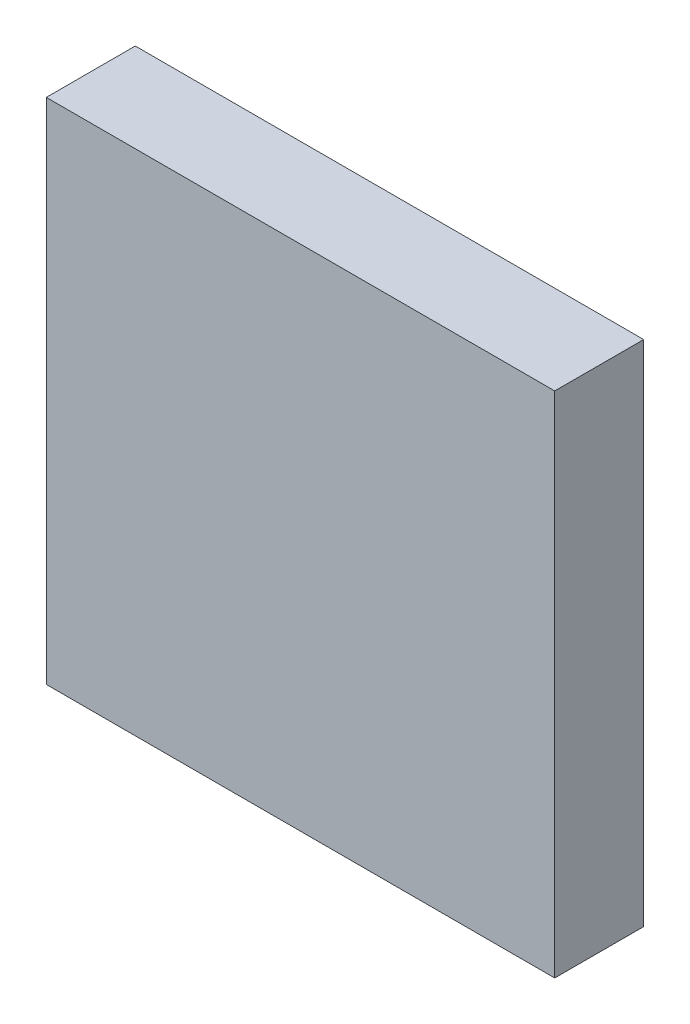
ISO-10303-21;
HEADER;
FILE_DESCRIPTION(('STEP AP214'),'2;1');
FILE_NAME('part.step','',(''),(''),'','','');
FILE_SCHEMA(('AUTOMOTIVE_DESIGN { 1 0 10303 214 1 1 1 1 }'));
ENDSEC;
DATA;
#1=APPLICATION_CONTEXT('core data for automotive mechanical design processes');
#2=APPLICATION_PROTOCOL_DEFINITION('international standard','automotive_design',2000,#1);
#3=PRODUCT_CONTEXT('',#1,'mechanical');
#4=PRODUCT('Part','Part','',(#3));
#5=PRODUCT_RELATED_PRODUCT_CATEGORY('part','',(#4));
#6=PRODUCT_DEFINITION_FORMATION('','',#4);
#7=PRODUCT_DEFINITION_CONTEXT('part definition',#1,'design');
#8=PRODUCT_DEFINITION('design','',#6,#7);
#9=PRODUCT_DEFINITION_SHAPE('','',#8);
#10=(LENGTH_UNIT() NAMED_UNIT(*) SI_UNIT(.MILLI.,.METRE.));
#11=(NAMED_UNIT(*) PLANE_ANGLE_UNIT() SI_UNIT($,.RADIAN.));
#12=(NAMED_UNIT(*) SI_UNIT($,.STERADIAN.) SOLID_ANGLE_UNIT());
#13=UNCERTAINTY_MEASURE_WITH_UNIT(LENGTH_MEASURE(1.E-05),#10,'distance_accuracy_value','');
#14=(GEOMETRIC_REPRESENTATION_CONTEXT(3) GLOBAL_UNCERTAINTY_ASSIGNED_CONTEXT((#13)) GLOBAL_UNIT_ASSIGNED_CONTEXT((#10,
#11,#12)) REPRESENTATION_CONTEXT('',''));
#15=CARTESIAN_POINT('',(0.,0.,0.));
#16=DIRECTION('',(0.,0.,1.));
#17=DIRECTION('',(1.,0.,0.));
#18=AXIS2_PLACEMENT_3D('',#15,#16,#17);
#19=CARTESIAN_POINT('',(-1000.,-1.11022302462516E-13,300.));
#20=DIRECTION('',(1.,0.,0.));
#21=DIRECTION('',(0.,1.,0.));
#22=AXIS2_PLACEMENT_3D('',#19,#20,#21);
#23=PLANE('',#22);
#24=DIRECTION('',(0.,-1.,0.));
#25=VECTOR('',#24,1.);
#26=CARTESIAN_POINT('',(-1000.,-1.11022302462516E-13,0.));
#27=LINE('',#26,#25);
#28=CARTESIAN_POINT('',(-1000.,1000.,0.));
#29=VERTEX_POINT('',#28);
#30=CARTESIAN_POINT('',(-999.999999999999,-1000.,0.));
#31=VERTEX_POINT('',#30);
#32=EDGE_CURVE('E408',#29,#31,#27,.T.);
#33=ORIENTED_EDGE('',*,*,#32,.T.);
#34=DIRECTION('',(0.,0.,-1.));
#35=VECTOR('',#34,1.);
#36=CARTESIAN_POINT('',(-999.999999999999,-1000.,300.));
#37=LINE('',#36,#35);
#38=CARTESIAN_POINT('',(-999.999999999999,-1000.,350.));
#39=VERTEX_POINT('',#38);
#40=EDGE_CURVE('E420',#39,#31,#37,.T.);
#41=ORIENTED_EDGE('',*,*,#40,.F.);
#42=DIRECTION('',(0.,-1.,0.));
#43=VECTOR('',#42,1.);
#44=CARTESIAN_POINT('',(-1000.,1000.,350.));
#45=LINE('',#44,#43);
#46=CARTESIAN_POINT('',(-1000.,1000.,350.));
#47=VERTEX_POINT('',#46);
#48=EDGE_CURVE('E300',#47,#39,#45,.T.);
#49=ORIENTED_EDGE('',*,*,#48,.F.);
#50=DIRECTION('',(0.,0.,-1.));
#51=VECTOR('',#50,1.);
#52=CARTESIAN_POINT('',(-1000.,1000.,300.));
#53=LINE('',#52,#51);
#54=EDGE_CURVE('E295',#47,#29,#53,.T.);
#55=ORIENTED_EDGE('',*,*,#54,.T.);
#56=EDGE_LOOP('',(#33,#41,#49,#55));
#57=FACE_BOUND('',#56,.T.);
#58=ADVANCED_FACE('F91',(#57),#23,.F.);
#59=CARTESIAN_POINT('',(0.,-1000.,300.));
#60=DIRECTION('',(0.,1.,0.));
#61=DIRECTION('',(0.,0.,1.));
#62=AXIS2_PLACEMENT_3D('',#59,#60,#61);
#63=PLANE('',#62);
#64=DIRECTION('',(1.,0.,0.));
#65=VECTOR('',#64,1.);
#66=CARTESIAN_POINT('',(0.,-1000.,0.));
#67=LINE('',#66,#65);
#68=CARTESIAN_POINT('',(1000.,-1000.,0.));
#69=VERTEX_POINT('',#68);
#70=EDGE_CURVE('E412',#31,#69,#67,.T.);
#71=ORIENTED_EDGE('',*,*,#70,.T.);
#72=DIRECTION('',(0.,0.,-1.));
#73=VECTOR('',#72,1.);
#74=CARTESIAN_POINT('',(1000.,-1000.,300.));
#75=LINE('',#74,#73);
#76=CARTESIAN_POINT('',(1000.,-1000.,350.));
#77=VERTEX_POINT('',#76);
#78=EDGE_CURVE('E289',#77,#69,#75,.T.);
#79=ORIENTED_EDGE('',*,*,#78,.F.);
#80=DIRECTION('',(1.,0.,0.));
#81=VECTOR('',#80,1.);
#82=CARTESIAN_POINT('',(-999.999999999999,-1000.,350.));
#83=LINE('',#82,#81);
#84=EDGE_CURVE('E305',#39,#77,#83,.T.);
#85=ORIENTED_EDGE('',*,*,#84,.F.);
#86=ORIENTED_EDGE('',*,*,#40,.T.);
#87=EDGE_LOOP('',(#71,#79,#85,#86));
#88=FACE_BOUND('',#87,.T.);
#89=ADVANCED_FACE('F697',(#88),#63,.F.);
#90=CARTESIAN_POINT('',(1000.,1.11022302462516E-13,300.));
#91=DIRECTION('',(1.,0.,0.));
#92=DIRECTION('',(0.,1.,0.));
#93=AXIS2_PLACEMENT_3D('',#90,#91,#92);
#94=PLANE('',#93);
#95=DIRECTION('',(0.,-1.,0.));
#96=VECTOR('',#95,1.);
#97=CARTESIAN_POINT('',(1000.,1.11022302462516E-13,0.));
#98=LINE('',#97,#96);
#99=CARTESIAN_POINT('',(1000.,1000.,0.));
#100=VERTEX_POINT('',#99);
#101=EDGE_CURVE('E284',#100,#69,#98,.T.);
#102=ORIENTED_EDGE('',*,*,#101,.F.);
#103=DIRECTION('',(0.,0.,-1.));
#104=VECTOR('',#103,1.);
#105=CARTESIAN_POINT('',(1000.,1000.,300.));
#106=LINE('',#105,#104);
#107=CARTESIAN_POINT('',(1000.,1000.,350.));
#108=VERTEX_POINT('',#107);
#109=EDGE_CURVE('E278',#108,#100,#106,.T.);
#110=ORIENTED_EDGE('',*,*,#109,.F.);
#111=DIRECTION('',(0.,1.,0.));
#112=VECTOR('',#111,1.);
#113=CARTESIAN_POINT('',(1000.,-1000.,350.));
#114=LINE('',#113,#112);
#115=EDGE_CURVE('E282',#77,#108,#114,.T.);
#116=ORIENTED_EDGE('',*,*,#115,.F.);
#117=ORIENTED_EDGE('',*,*,#78,.T.);
#118=EDGE_LOOP('',(#102,#110,#116,#117));
#119=FACE_BOUND('',#118,.T.);
#120=ADVANCED_FACE('F280',(#119),#94,.T.);
#121=CARTESIAN_POINT('',(0.,1000.,300.));
#122=DIRECTION('',(0.,1.,0.));
#123=DIRECTION('',(0.,0.,1.));
#124=AXIS2_PLACEMENT_3D('',#121,#122,#123);
#125=PLANE('',#124);
#126=DIRECTION('',(1.,0.,0.));
#127=VECTOR('',#126,1.);
#128=CARTESIAN_POINT('',(0.,1000.,0.));
#129=LINE('',#128,#127);
#130=EDGE_CURVE('E405',#29,#100,#129,.T.);
#131=ORIENTED_EDGE('',*,*,#130,.F.);
#132=ORIENTED_EDGE('',*,*,#54,.F.);
#133=DIRECTION('',(-1.,0.,0.));
#134=VECTOR('',#133,1.);
#135=CARTESIAN_POINT('',(1000.,1000.,350.));
#136=LINE('',#135,#134);
#137=EDGE_CURVE('E293',#108,#47,#136,.T.);
#138=ORIENTED_EDGE('',*,*,#137,.F.);
#139=ORIENTED_EDGE('',*,*,#109,.T.);
#140=EDGE_LOOP('',(#131,#132,#138,#139));
#141=FACE_BOUND('',#140,.T.);
#142=ADVANCED_FACE('F294',(#141),#125,.T.);
#143=CARTESIAN_POINT('',(950.,1.11022302462516E-13,300.));
#144=DIRECTION('',(1.,0.,0.));
#145=DIRECTION('',(0.,1.,0.));
#146=AXIS2_PLACEMENT_3D('',#143,#144,#145);
#147=PLANE('',#146);
#148=DIRECTION('',(0.,-1.,0.));
#149=VECTOR('',#148,1.);
#150=CARTESIAN_POINT('',(950.,1.11022302462516E-13,0.));
#151=LINE('',#150,#149);
#152=CARTESIAN_POINT('',(950.,950.,0.));
#153=VERTEX_POINT('',#152);
#154=CARTESIAN_POINT('',(950.,650.,0.));
#155=VERTEX_POINT('',#154);
#156=EDGE_CURVE('E398',#153,#155,#151,.T.);
#157=ORIENTED_EDGE('',*,*,#156,.T.);
#158=DIRECTION('',(0.,0.,-1.));
#159=VECTOR('',#158,1.);
#160=CARTESIAN_POINT('',(950.,650.,300.));
#161=LINE('',#160,#159);
#162=CARTESIAN_POINT('',(950.,650.,300.));
#163=VERTEX_POINT('',#162);
#164=EDGE_CURVE('E434',#163,#155,#161,.T.);
#165=ORIENTED_EDGE('',*,*,#164,.F.);
#166=DIRECTION('',(0.,-1.,0.));
#167=VECTOR('',#166,1.);
#168=CARTESIAN_POINT('',(950.,1.11022302462516E-13,300.));
#169=LINE('',#168,#167);
#170=CARTESIAN_POINT('',(950.,950.,300.));
#171=VERTEX_POINT('',#170);
#172=EDGE_CURVE('E350',#171,#163,#169,.T.);
#173=ORIENTED_EDGE('',*,*,#172,.F.);
#174=DIRECTION('',(0.,0.,-1.));
#175=VECTOR('',#174,1.);
#176=CARTESIAN_POINT('',(950.,950.,300.));
#177=LINE('',#176,#175);
#178=EDGE_CURVE('E290',#171,#153,#177,.T.);
#179=ORIENTED_EDGE('',*,*,#178,.T.);
#180=EDGE_LOOP('',(#157,#165,#173,#179));
#181=FACE_BOUND('',#180,.T.);
#182=ADVANCED_FACE('F547',(#181),#147,.F.);
#183=CARTESIAN_POINT('',(0.,650.,300.));
#184=DIRECTION('',(0.,1.,0.));
#185=DIRECTION('',(0.,0.,1.));
#186=AXIS2_PLACEMENT_3D('',#183,#184,#185);
#187=PLANE('',#186);
#188=DIRECTION('',(1.,0.,0.));
#189=VECTOR('',#188,1.);
#190=CARTESIAN_POINT('',(0.,650.,0.));
#191=LINE('',#190,#189);
#192=CARTESIAN_POINT('',(-950.,650.,0.));
#193=VERTEX_POINT('',#192);
#194=EDGE_CURVE('E400',#193,#155,#191,.T.);
#195=ORIENTED_EDGE('',*,*,#194,.F.);
#196=DIRECTION('',(0.,0.,-1.));
#197=VECTOR('',#196,1.);
#198=CARTESIAN_POINT('',(-950.,650.,300.));
#199=LINE('',#198,#197);
#200=CARTESIAN_POINT('',(-950.,650.,300.));
#201=VERTEX_POINT('',#200);
#202=EDGE_CURVE('E430',#201,#193,#199,.T.);
#203=ORIENTED_EDGE('',*,*,#202,.F.);
#204=DIRECTION('',(1.,0.,0.));
#205=VECTOR('',#204,1.);
#206=CARTESIAN_POINT('',(0.,650.,300.));
#207=LINE('',#206,#205);
#208=EDGE_CURVE('E352',#201,#163,#207,.T.);
#209=ORIENTED_EDGE('',*,*,#208,.T.);
#210=ORIENTED_EDGE('',*,*,#164,.T.);
#211=EDGE_LOOP('',(#195,#203,#209,#210));
#212=FACE_BOUND('',#211,.T.);
#213=ADVANCED_FACE('F558',(#212),#187,.T.);
#214=CARTESIAN_POINT('',(-950.,-1.11022302462516E-13,300.));
#215=DIRECTION('',(1.,0.,0.));
#216=DIRECTION('',(0.,1.,0.));
#217=AXIS2_PLACEMENT_3D('',#214,#215,#216);
#218=PLANE('',#217);
#219=DIRECTION('',(0.,-1.,0.));
#220=VECTOR('',#219,1.);
#221=CARTESIAN_POINT('',(-950.,-1.11022302462516E-13,0.));
#222=LINE('',#221,#220);
#223=CARTESIAN_POINT('',(-950.,950.,0.));
#224=VERTEX_POINT('',#223);
#225=EDGE_CURVE('E404',#224,#193,#222,.T.);
#226=ORIENTED_EDGE('',*,*,#225,.F.);
#227=DIRECTION('',(0.,0.,-1.));
#228=VECTOR('',#227,1.);
#229=CARTESIAN_POINT('',(-950.,950.,300.));
#230=LINE('',#229,#228);
#231=CARTESIAN_POINT('',(-950.,950.,300.));
#232=VERTEX_POINT('',#231);
#233=EDGE_CURVE('E427',#232,#224,#230,.T.);
#234=ORIENTED_EDGE('',*,*,#233,.F.);
#235=DIRECTION('',(0.,-1.,0.));
#236=VECTOR('',#235,1.);
#237=CARTESIAN_POINT('',(-950.,-1.11022302462516E-13,300.));
#238=LINE('',#237,#236);
#239=EDGE_CURVE('E356',#232,#201,#238,.T.);
#240=ORIENTED_EDGE('',*,*,#239,.T.);
#241=ORIENTED_EDGE('',*,*,#202,.T.);
#242=EDGE_LOOP('',(#226,#234,#240,#241));
#243=FACE_BOUND('',#242,.T.);
#244=ADVANCED_FACE('F595',(#243),#218,.T.);
#245=CARTESIAN_POINT('',(0.,950.,300.));
#246=DIRECTION('',(0.,1.,0.));
#247=DIRECTION('',(0.,0.,1.));
#248=AXIS2_PLACEMENT_3D('',#245,#246,#247);
#249=PLANE('',#248);
#250=DIRECTION('',(1.,0.,0.));
#251=VECTOR('',#250,1.);
#252=CARTESIAN_POINT('',(0.,950.,0.));
#253=LINE('',#252,#251);
#254=EDGE_CURVE('E394',#224,#153,#253,.T.);
#255=ORIENTED_EDGE('',*,*,#254,.T.);
#256=ORIENTED_EDGE('',*,*,#178,.F.);
#257=DIRECTION('',(1.,0.,0.));
#258=VECTOR('',#257,1.);
#259=CARTESIAN_POINT('',(0.,950.,300.));
#260=LINE('',#259,#258);
#261=EDGE_CURVE('E347',#232,#171,#260,.T.);
#262=ORIENTED_EDGE('',*,*,#261,.F.);
#263=ORIENTED_EDGE('',*,*,#233,.T.);
#264=EDGE_LOOP('',(#255,#256,#262,#263));
#265=FACE_BOUND('',#264,.T.);
#266=ADVANCED_FACE('F597',(#265),#249,.F.);
#267=CARTESIAN_POINT('',(950.,-100.024,0.));
#268=VERTEX_POINT('',#267);
#269=CARTESIAN_POINT('',(950.,-400.036,0.));
#270=VERTEX_POINT('',#269);
#271=EDGE_CURVE('E393',#268,#270,#151,.T.);
#272=ORIENTED_EDGE('',*,*,#271,.T.);
#273=DIRECTION('',(0.,0.,1.));
#274=VECTOR('',#273,1.);
#275=CARTESIAN_POINT('',(950.,-400.036,300.));
#276=LINE('',#275,#274);
#277=CARTESIAN_POINT('',(950.,-400.036,300.));
#278=VERTEX_POINT('',#277);
#279=EDGE_CURVE('E101',#270,#278,#276,.T.);
#280=ORIENTED_EDGE('',*,*,#279,.T.);
#281=CARTESIAN_POINT('',(950.,-100.024,300.));
#282=VERTEX_POINT('',#281);
#283=EDGE_CURVE('E346',#282,#278,#169,.T.);
#284=ORIENTED_EDGE('',*,*,#283,.F.);
#285=DIRECTION('',(0.,0.,-1.));
#286=VECTOR('',#285,1.);
#287=CARTESIAN_POINT('',(950.,-100.024,300.));
#288=LINE('',#287,#286);
#289=EDGE_CURVE('E431',#282,#268,#288,.T.);
#290=ORIENTED_EDGE('',*,*,#289,.T.);
#291=EDGE_LOOP('',(#272,#280,#284,#290));
#292=FACE_BOUND('',#291,.T.);
#293=ADVANCED_FACE('F599',(#292),#147,.F.);
#294=CARTESIAN_POINT('',(950.,-450.036,300.));
#295=VERTEX_POINT('',#294);
#296=CARTESIAN_POINT('',(950.,-750.048,300.));
#297=VERTEX_POINT('',#296);
#298=EDGE_CURVE('E565',#295,#297,#169,.T.);
#299=ORIENTED_EDGE('',*,*,#298,.F.);
#300=DIRECTION('',(0.,0.,-1.));
#301=VECTOR('',#300,1.);
#302=CARTESIAN_POINT('',(950.000000000011,-450.036,300.));
#303=LINE('',#302,#301);
#304=CARTESIAN_POINT('',(950.,-450.036,0.));
#305=VERTEX_POINT('',#304);
#306=EDGE_CURVE('E12',#295,#305,#303,.T.);
#307=ORIENTED_EDGE('',*,*,#306,.T.);
#308=CARTESIAN_POINT('',(950.,-750.048,0.));
#309=VERTEX_POINT('',#308);
#310=EDGE_CURVE('E531',#305,#309,#151,.T.);
#311=ORIENTED_EDGE('',*,*,#310,.T.);
#312=DIRECTION('',(0.,0.,1.));
#313=VECTOR('',#312,1.);
#314=CARTESIAN_POINT('',(950.,-750.048,300.));
#315=LINE('',#314,#313);
#316=EDGE_CURVE('E493',#309,#297,#315,.T.);
#317=ORIENTED_EDGE('',*,*,#316,.T.);
#318=EDGE_LOOP('',(#299,#307,#311,#317));
#319=FACE_BOUND('',#318,.T.);
#320=ADVANCED_FACE('F537',(#319),#147,.F.);
#321=CARTESIAN_POINT('',(950.,-800.048,300.));
#322=VERTEX_POINT('',#321);
#323=CARTESIAN_POINT('',(950.,-950.,300.));
#324=VERTEX_POINT('',#323);
#325=EDGE_CURVE('E321',#322,#324,#169,.T.);
#326=ORIENTED_EDGE('',*,*,#325,.F.);
#327=DIRECTION('',(0.,0.,-1.));
#328=VECTOR('',#327,1.);
#329=CARTESIAN_POINT('',(950.000000000015,-800.048,300.));
#330=LINE('',#329,#328);
#331=CARTESIAN_POINT('',(950.,-800.048,0.));
#332=VERTEX_POINT('',#331);
#333=EDGE_CURVE('E95',#322,#332,#330,.T.);
#334=ORIENTED_EDGE('',*,*,#333,.T.);
#335=CARTESIAN_POINT('',(950.,-950.,0.));
#336=VERTEX_POINT('',#335);
#337=EDGE_CURVE('E366',#332,#336,#151,.T.);
#338=ORIENTED_EDGE('',*,*,#337,.T.);
#339=DIRECTION('',(0.,0.,-1.));
#340=VECTOR('',#339,1.);
#341=CARTESIAN_POINT('',(950.,-950.,300.));
#342=LINE('',#341,#340);
#343=EDGE_CURVE('E448',#324,#336,#342,.T.);
#344=ORIENTED_EDGE('',*,*,#343,.F.);
#345=EDGE_LOOP('',(#326,#334,#338,#344));
#346=FACE_BOUND('',#345,.T.);
#347=ADVANCED_FACE('F577',(#346),#147,.F.);
#348=CARTESIAN_POINT('',(0.,-950.,300.));
#349=DIRECTION('',(0.,1.,0.));
#350=DIRECTION('',(0.,0.,1.));
#351=AXIS2_PLACEMENT_3D('',#348,#349,#350);
#352=PLANE('',#351);
#353=DIRECTION('',(1.,0.,0.));
#354=VECTOR('',#353,1.);
#355=CARTESIAN_POINT('',(0.,-950.,0.));
#356=LINE('',#355,#354);
#357=CARTESIAN_POINT('',(-950.,-950.,0.));
#358=VERTEX_POINT('',#357);
#359=EDGE_CURVE('E389',#358,#336,#356,.T.);
#360=ORIENTED_EDGE('',*,*,#359,.F.);
#361=DIRECTION('',(0.,0.,-1.));
#362=VECTOR('',#361,1.);
#363=CARTESIAN_POINT('',(-950.,-950.,300.));
#364=LINE('',#363,#362);
#365=CARTESIAN_POINT('',(-950.,-950.,300.));
#366=VERTEX_POINT('',#365);
#367=EDGE_CURVE('E443',#366,#358,#364,.T.);
#368=ORIENTED_EDGE('',*,*,#367,.F.);
#369=DIRECTION('',(1.,0.,0.));
#370=VECTOR('',#369,1.);
#371=CARTESIAN_POINT('',(0.,-950.,300.));
#372=LINE('',#371,#370);
#373=EDGE_CURVE('E342',#366,#324,#372,.T.);
#374=ORIENTED_EDGE('',*,*,#373,.T.);
#375=ORIENTED_EDGE('',*,*,#343,.T.);
#376=EDGE_LOOP('',(#360,#368,#374,#375));
#377=FACE_BOUND('',#376,.T.);
#378=ADVANCED_FACE('F582',(#377),#352,.T.);
#379=CARTESIAN_POINT('',(-950.,-800.048,0.));
#380=VERTEX_POINT('',#379);
#381=EDGE_CURVE('E376',#380,#358,#222,.T.);
#382=ORIENTED_EDGE('',*,*,#381,.F.);
#383=DIRECTION('',(0.,0.,1.));
#384=VECTOR('',#383,1.);
#385=CARTESIAN_POINT('',(-950.,-800.048,300.));
#386=LINE('',#385,#384);
#387=CARTESIAN_POINT('',(-950.,-800.048,300.));
#388=VERTEX_POINT('',#387);
#389=EDGE_CURVE('E482',#380,#388,#386,.T.);
#390=ORIENTED_EDGE('',*,*,#389,.T.);
#391=EDGE_CURVE('E331',#388,#366,#238,.T.);
#392=ORIENTED_EDGE('',*,*,#391,.T.);
#393=ORIENTED_EDGE('',*,*,#367,.T.);
#394=EDGE_LOOP('',(#382,#390,#392,#393));
#395=FACE_BOUND('',#394,.T.);
#396=ADVANCED_FACE('F585',(#395),#218,.T.);
#397=CARTESIAN_POINT('',(-950.,-450.036,0.));
#398=VERTEX_POINT('',#397);
#399=CARTESIAN_POINT('',(-950.,-750.048,0.));
#400=VERTEX_POINT('',#399);
#401=EDGE_CURVE('E533',#398,#400,#222,.T.);
#402=ORIENTED_EDGE('',*,*,#401,.F.);
#403=DIRECTION('',(0.,0.,1.));
#404=VECTOR('',#403,1.);
#405=CARTESIAN_POINT('',(-950.,-450.036,300.));
#406=LINE('',#405,#404);
#407=CARTESIAN_POINT('',(-950.,-450.036,300.));
#408=VERTEX_POINT('',#407);
#409=EDGE_CURVE('E489',#398,#408,#406,.T.);
#410=ORIENTED_EDGE('',*,*,#409,.T.);
#411=CARTESIAN_POINT('',(-950.,-750.048,300.));
#412=VERTEX_POINT('',#411);
#413=EDGE_CURVE('E587',#408,#412,#238,.T.);
#414=ORIENTED_EDGE('',*,*,#413,.T.);
#415=DIRECTION('',(0.,0.,1.));
#416=VECTOR('',#415,1.);
#417=CARTESIAN_POINT('',(-950.,-750.048,300.));
#418=LINE('',#417,#416);
#419=EDGE_CURVE('E426',#400,#412,#418,.T.);
#420=ORIENTED_EDGE('',*,*,#419,.F.);
#421=EDGE_LOOP('',(#402,#410,#414,#420));
#422=FACE_BOUND('',#421,.T.);
#423=ADVANCED_FACE('F609',(#422),#218,.T.);
#424=DIRECTION('',(0.,0.,1.));
#425=VECTOR('',#424,1.);
#426=CARTESIAN_POINT('',(-950.,-400.036,300.));
#427=LINE('',#426,#425);
#428=CARTESIAN_POINT('',(-950.,-400.036,0.));
#429=VERTEX_POINT('',#428);
#430=CARTESIAN_POINT('',(-950.,-400.036,300.));
#431=VERTEX_POINT('',#430);
#432=EDGE_CURVE('E486',#429,#431,#427,.T.);
#433=ORIENTED_EDGE('',*,*,#432,.F.);
#434=CARTESIAN_POINT('',(-950.,-100.024,0.));
#435=VERTEX_POINT('',#434);
#436=EDGE_CURVE('E399',#435,#429,#222,.T.);
#437=ORIENTED_EDGE('',*,*,#436,.F.);
#438=DIRECTION('',(0.,0.,-1.));
#439=VECTOR('',#438,1.);
#440=CARTESIAN_POINT('',(-950.,-100.024,300.));
#441=LINE('',#440,#439);
#442=CARTESIAN_POINT('',(-950.,-100.024,300.));
#443=VERTEX_POINT('',#442);
#444=EDGE_CURVE('E440',#443,#435,#441,.T.);
#445=ORIENTED_EDGE('',*,*,#444,.F.);
#446=EDGE_CURVE('E351',#443,#431,#238,.T.);
#447=ORIENTED_EDGE('',*,*,#446,.T.);
#448=EDGE_LOOP('',(#433,#437,#445,#447));
#449=FACE_BOUND('',#448,.T.);
#450=ADVANCED_FACE('F610',(#449),#218,.T.);
#451=CARTESIAN_POINT('',(0.,-100.024,300.));
#452=DIRECTION('',(0.,1.,0.));
#453=DIRECTION('',(0.,0.,1.));
#454=AXIS2_PLACEMENT_3D('',#451,#452,#453);
#455=PLANE('',#454);
#456=DIRECTION('',(1.,0.,0.));
#457=VECTOR('',#456,1.);
#458=CARTESIAN_POINT('',(0.,-100.024,0.));
#459=LINE('',#458,#457);
#460=EDGE_CURVE('E385',#435,#268,#459,.T.);
#461=ORIENTED_EDGE('',*,*,#460,.T.);
#462=ORIENTED_EDGE('',*,*,#289,.F.);
#463=DIRECTION('',(1.,0.,0.));
#464=VECTOR('',#463,1.);
#465=CARTESIAN_POINT('',(0.,-100.024,300.));
#466=LINE('',#465,#464);
#467=EDGE_CURVE('E339',#443,#282,#466,.T.);
#468=ORIENTED_EDGE('',*,*,#467,.F.);
#469=ORIENTED_EDGE('',*,*,#444,.T.);
#470=EDGE_LOOP('',(#461,#462,#468,#469));
#471=FACE_BOUND('',#470,.T.);
#472=ADVANCED_FACE('F720',(#471),#455,.F.);
#473=CARTESIAN_POINT('',(950.,249.988,0.));
#474=VERTEX_POINT('',#473);
#475=CARTESIAN_POINT('',(950.,-50.0240000000001,0.));
#476=VERTEX_POINT('',#475);
#477=EDGE_CURVE('E367',#474,#476,#151,.T.);
#478=ORIENTED_EDGE('',*,*,#477,.T.);
#479=DIRECTION('',(0.,0.,-1.));
#480=VECTOR('',#479,1.);
#481=CARTESIAN_POINT('',(950.,-50.0240000000001,300.));
#482=LINE('',#481,#480);
#483=CARTESIAN_POINT('',(950.,-50.0240000000001,300.));
#484=VERTEX_POINT('',#483);
#485=EDGE_CURVE('E462',#484,#476,#482,.T.);
#486=ORIENTED_EDGE('',*,*,#485,.F.);
#487=CARTESIAN_POINT('',(950.,249.988,300.));
#488=VERTEX_POINT('',#487);
#489=EDGE_CURVE('E322',#488,#484,#169,.T.);
#490=ORIENTED_EDGE('',*,*,#489,.F.);
#491=DIRECTION('',(0.,0.,-1.));
#492=VECTOR('',#491,1.);
#493=CARTESIAN_POINT('',(950.,249.988,300.));
#494=LINE('',#493,#492);
#495=EDGE_CURVE('E444',#488,#474,#494,.T.);
#496=ORIENTED_EDGE('',*,*,#495,.T.);
#497=EDGE_LOOP('',(#478,#486,#490,#496));
#498=FACE_BOUND('',#497,.T.);
#499=ADVANCED_FACE('F607',(#498),#147,.F.);
#500=CARTESIAN_POINT('',(0.,-50.0240000000001,300.));
#501=DIRECTION('',(0.,1.,0.));
#502=DIRECTION('',(0.,0.,1.));
#503=AXIS2_PLACEMENT_3D('',#500,#501,#502);
#504=PLANE('',#503);
#505=DIRECTION('',(1.,0.,0.));
#506=VECTOR('',#505,1.);
#507=CARTESIAN_POINT('',(0.,-50.0240000000001,0.));
#508=LINE('',#507,#506);
#509=CARTESIAN_POINT('',(-950.,-50.0240000000001,0.));
#510=VERTEX_POINT('',#509);
#511=EDGE_CURVE('E381',#510,#476,#508,.T.);
#512=ORIENTED_EDGE('',*,*,#511,.F.);
#513=DIRECTION('',(0.,0.,-1.));
#514=VECTOR('',#513,1.);
#515=CARTESIAN_POINT('',(-950.,-50.0240000000001,300.));
#516=LINE('',#515,#514);
#517=CARTESIAN_POINT('',(-950.,-50.0240000000001,300.));
#518=VERTEX_POINT('',#517);
#519=EDGE_CURVE('E458',#518,#510,#516,.T.);
#520=ORIENTED_EDGE('',*,*,#519,.F.);
#521=DIRECTION('',(1.,0.,0.));
#522=VECTOR('',#521,1.);
#523=CARTESIAN_POINT('',(0.,-50.0240000000001,300.));
#524=LINE('',#523,#522);
#525=EDGE_CURVE('E335',#518,#484,#524,.T.);
#526=ORIENTED_EDGE('',*,*,#525,.T.);
#527=ORIENTED_EDGE('',*,*,#485,.T.);
#528=EDGE_LOOP('',(#512,#520,#526,#527));
#529=FACE_BOUND('',#528,.T.);
#530=ADVANCED_FACE('F644',(#529),#504,.T.);
#531=CARTESIAN_POINT('',(-950.,249.988,0.));
#532=VERTEX_POINT('',#531);
#533=EDGE_CURVE('E377',#532,#510,#222,.T.);
#534=ORIENTED_EDGE('',*,*,#533,.F.);
#535=DIRECTION('',(0.,0.,-1.));
#536=VECTOR('',#535,1.);
#537=CARTESIAN_POINT('',(-950.,249.988,300.));
#538=LINE('',#537,#536);
#539=CARTESIAN_POINT('',(-950.,249.988,300.));
#540=VERTEX_POINT('',#539);
#541=EDGE_CURVE('E455',#540,#532,#538,.T.);
#542=ORIENTED_EDGE('',*,*,#541,.F.);
#543=EDGE_CURVE('E332',#540,#518,#238,.T.);
#544=ORIENTED_EDGE('',*,*,#543,.T.);
#545=ORIENTED_EDGE('',*,*,#519,.T.);
#546=EDGE_LOOP('',(#534,#542,#544,#545));
#547=FACE_BOUND('',#546,.T.);
#548=ADVANCED_FACE('F635',(#547),#218,.T.);
#549=CARTESIAN_POINT('',(0.,249.988,300.));
#550=DIRECTION('',(0.,1.,0.));
#551=DIRECTION('',(0.,0.,1.));
#552=AXIS2_PLACEMENT_3D('',#549,#550,#551);
#553=PLANE('',#552);
#554=DIRECTION('',(1.,0.,0.));
#555=VECTOR('',#554,1.);
#556=CARTESIAN_POINT('',(0.,249.988,0.));
#557=LINE('',#556,#555);
#558=EDGE_CURVE('E375',#532,#474,#557,.T.);
#559=ORIENTED_EDGE('',*,*,#558,.T.);
#560=ORIENTED_EDGE('',*,*,#495,.F.);
#561=DIRECTION('',(1.,0.,0.));
#562=VECTOR('',#561,1.);
#563=CARTESIAN_POINT('',(0.,249.988,300.));
#564=LINE('',#563,#562);
#565=EDGE_CURVE('E330',#540,#488,#564,.T.);
#566=ORIENTED_EDGE('',*,*,#565,.F.);
#567=ORIENTED_EDGE('',*,*,#541,.T.);
#568=EDGE_LOOP('',(#559,#560,#566,#567));
#569=FACE_BOUND('',#568,.T.);
#570=ADVANCED_FACE('F655',(#569),#553,.F.);
#571=CARTESIAN_POINT('',(950.,600.,0.));
#572=VERTEX_POINT('',#571);
#573=CARTESIAN_POINT('',(950.,299.988,0.));
#574=VERTEX_POINT('',#573);
#575=EDGE_CURVE('E361',#572,#574,#151,.T.);
#576=ORIENTED_EDGE('',*,*,#575,.T.);
#577=DIRECTION('',(0.,0.,-1.));
#578=VECTOR('',#577,1.);
#579=CARTESIAN_POINT('',(950.,299.988,300.));
#580=LINE('',#579,#578);
#581=CARTESIAN_POINT('',(950.,299.988,300.));
#582=VERTEX_POINT('',#581);
#583=EDGE_CURVE('E474',#582,#574,#580,.T.);
#584=ORIENTED_EDGE('',*,*,#583,.F.);
#585=CARTESIAN_POINT('',(950.,600.,300.));
#586=VERTEX_POINT('',#585);
#587=EDGE_CURVE('E317',#586,#582,#169,.T.);
#588=ORIENTED_EDGE('',*,*,#587,.F.);
#589=DIRECTION('',(0.,0.,-1.));
#590=VECTOR('',#589,1.);
#591=CARTESIAN_POINT('',(950.,600.,300.));
#592=LINE('',#591,#590);
#593=EDGE_CURVE('E459',#586,#572,#592,.T.);
#594=ORIENTED_EDGE('',*,*,#593,.T.);
#595=EDGE_LOOP('',(#576,#584,#588,#594));
#596=FACE_BOUND('',#595,.T.);
#597=ADVANCED_FACE('F657',(#596),#147,.F.);
#598=CARTESIAN_POINT('',(0.,299.988,300.));
#599=DIRECTION('',(0.,1.,0.));
#600=DIRECTION('',(0.,0.,1.));
#601=AXIS2_PLACEMENT_3D('',#598,#599,#600);
#602=PLANE('',#601);
#603=DIRECTION('',(1.,0.,0.));
#604=VECTOR('',#603,1.);
#605=CARTESIAN_POINT('',(0.,299.988,0.));
#606=LINE('',#605,#604);
#607=CARTESIAN_POINT('',(-950.,299.988,0.));
#608=VERTEX_POINT('',#607);
#609=EDGE_CURVE('E365',#608,#574,#606,.T.);
#610=ORIENTED_EDGE('',*,*,#609,.F.);
#611=DIRECTION('',(0.,0.,-1.));
#612=VECTOR('',#611,1.);
#613=CARTESIAN_POINT('',(-950.,299.988,300.));
#614=LINE('',#613,#612);
#615=CARTESIAN_POINT('',(-950.,299.988,300.));
#616=VERTEX_POINT('',#615);
#617=EDGE_CURVE('E471',#616,#608,#614,.T.);
#618=ORIENTED_EDGE('',*,*,#617,.F.);
#619=DIRECTION('',(1.,0.,0.));
#620=VECTOR('',#619,1.);
#621=CARTESIAN_POINT('',(0.,299.988,300.));
#622=LINE('',#621,#620);
#623=EDGE_CURVE('E320',#616,#582,#622,.T.);
#624=ORIENTED_EDGE('',*,*,#623,.T.);
#625=ORIENTED_EDGE('',*,*,#583,.T.);
#626=EDGE_LOOP('',(#610,#618,#624,#625));
#627=FACE_BOUND('',#626,.T.);
#628=ADVANCED_FACE('F663',(#627),#602,.T.);
#629=CARTESIAN_POINT('',(-950.,600.,0.));
#630=VERTEX_POINT('',#629);
#631=EDGE_CURVE('E371',#630,#608,#222,.T.);
#632=ORIENTED_EDGE('',*,*,#631,.F.);
#633=DIRECTION('',(0.,0.,-1.));
#634=VECTOR('',#633,1.);
#635=CARTESIAN_POINT('',(-950.,600.,300.));
#636=LINE('',#635,#634);
#637=CARTESIAN_POINT('',(-950.,600.,300.));
#638=VERTEX_POINT('',#637);
#639=EDGE_CURVE('E468',#638,#630,#636,.T.);
#640=ORIENTED_EDGE('',*,*,#639,.F.);
#641=EDGE_CURVE('E326',#638,#616,#238,.T.);
#642=ORIENTED_EDGE('',*,*,#641,.T.);
#643=ORIENTED_EDGE('',*,*,#617,.T.);
#644=EDGE_LOOP('',(#632,#640,#642,#643));
#645=FACE_BOUND('',#644,.T.);
#646=ADVANCED_FACE('F665',(#645),#218,.T.);
#647=CARTESIAN_POINT('',(0.,600.,300.));
#648=DIRECTION('',(0.,1.,0.));
#649=DIRECTION('',(0.,0.,1.));
#650=AXIS2_PLACEMENT_3D('',#647,#648,#649);
#651=PLANE('',#650);
#652=DIRECTION('',(1.,0.,0.));
#653=VECTOR('',#652,1.);
#654=CARTESIAN_POINT('',(0.,600.,0.));
#655=LINE('',#654,#653);
#656=EDGE_CURVE('E357',#630,#572,#655,.T.);
#657=ORIENTED_EDGE('',*,*,#656,.T.);
#658=ORIENTED_EDGE('',*,*,#593,.F.);
#659=DIRECTION('',(1.,0.,0.));
#660=VECTOR('',#659,1.);
#661=CARTESIAN_POINT('',(0.,600.,300.));
#662=LINE('',#661,#660);
#663=EDGE_CURVE('E314',#638,#586,#662,.T.);
#664=ORIENTED_EDGE('',*,*,#663,.F.);
#665=ORIENTED_EDGE('',*,*,#639,.T.);
#666=EDGE_LOOP('',(#657,#658,#664,#665));
#667=FACE_BOUND('',#666,.T.);
#668=ADVANCED_FACE('F620',(#667),#651,.F.);
#669=CARTESIAN_POINT('',(0.,0.,0.));
#670=DIRECTION('',(0.,0.,1.));
#671=DIRECTION('',(1.,0.,0.));
#672=AXIS2_PLACEMENT_3D('',#669,#670,#671);
#673=PLANE('',#672);
#674=ORIENTED_EDGE('',*,*,#337,.F.);
#675=DIRECTION('',(1.,0.,0.));
#676=VECTOR('',#675,1.);
#677=CARTESIAN_POINT('',(-949.999999999985,-800.048,0.));
#678=LINE('',#677,#676);
#679=EDGE_CURVE('E313',#380,#332,#678,.T.);
#680=ORIENTED_EDGE('',*,*,#679,.F.);
#681=ORIENTED_EDGE('',*,*,#381,.T.);
#682=ORIENTED_EDGE('',*,*,#359,.T.);
#683=EDGE_LOOP('',(#674,#680,#681,#682));
#684=FACE_BOUND('',#683,.T.);
#685=ORIENTED_EDGE('',*,*,#310,.F.);
#686=DIRECTION('',(1.,0.,0.));
#687=VECTOR('',#686,1.);
#688=CARTESIAN_POINT('',(-949.999999999989,-450.036,0.));
#689=LINE('',#688,#687);
#690=EDGE_CURVE('E506',#398,#305,#689,.T.);
#691=ORIENTED_EDGE('',*,*,#690,.F.);
#692=ORIENTED_EDGE('',*,*,#401,.T.);
#693=DIRECTION('',(1.,0.,0.));
#694=VECTOR('',#693,1.);
#695=CARTESIAN_POINT('',(-949.999999999985,-750.048,0.));
#696=LINE('',#695,#694);
#697=EDGE_CURVE('E516',#400,#309,#696,.T.);
#698=ORIENTED_EDGE('',*,*,#697,.T.);
#699=EDGE_LOOP('',(#685,#691,#692,#698));
#700=FACE_BOUND('',#699,.T.);
#701=ORIENTED_EDGE('',*,*,#656,.F.);
#702=ORIENTED_EDGE('',*,*,#631,.T.);
#703=ORIENTED_EDGE('',*,*,#609,.T.);
#704=ORIENTED_EDGE('',*,*,#575,.F.);
#705=EDGE_LOOP('',(#701,#702,#703,#704));
#706=FACE_BOUND('',#705,.T.);
#707=ORIENTED_EDGE('',*,*,#558,.F.);
#708=ORIENTED_EDGE('',*,*,#533,.T.);
#709=ORIENTED_EDGE('',*,*,#511,.T.);
#710=ORIENTED_EDGE('',*,*,#477,.F.);
#711=EDGE_LOOP('',(#707,#708,#709,#710));
#712=FACE_BOUND('',#711,.T.);
#713=ORIENTED_EDGE('',*,*,#460,.F.);
#714=ORIENTED_EDGE('',*,*,#436,.T.);
#715=DIRECTION('',(1.,0.,0.));
#716=VECTOR('',#715,1.);
#717=CARTESIAN_POINT('',(-949.999999999989,-400.036,0.));
#718=LINE('',#717,#716);
#719=EDGE_CURVE('E503',#429,#270,#718,.T.);
#720=ORIENTED_EDGE('',*,*,#719,.T.);
#721=ORIENTED_EDGE('',*,*,#271,.F.);
#722=EDGE_LOOP('',(#713,#714,#720,#721));
#723=FACE_BOUND('',#722,.T.);
#724=ORIENTED_EDGE('',*,*,#254,.F.);
#725=ORIENTED_EDGE('',*,*,#225,.T.);
#726=ORIENTED_EDGE('',*,*,#194,.T.);
#727=ORIENTED_EDGE('',*,*,#156,.F.);
#728=EDGE_LOOP('',(#724,#725,#726,#727));
#729=FACE_BOUND('',#728,.T.);
#730=ORIENTED_EDGE('',*,*,#130,.T.);
#731=ORIENTED_EDGE('',*,*,#101,.T.);
#732=ORIENTED_EDGE('',*,*,#70,.F.);
#733=ORIENTED_EDGE('',*,*,#32,.F.);
#734=EDGE_LOOP('',(#730,#731,#732,#733));
#735=FACE_BOUND('',#734,.T.);
#736=ADVANCED_FACE('F528',(#684,#700,#706,#712,#723,#729,#735),#673,.F.);
#737=CARTESIAN_POINT('',(-949.999999999985,-800.048,300.));
#738=DIRECTION('',(0.,1.,0.));
#739=DIRECTION('',(0.,0.,1.));
#740=AXIS2_PLACEMENT_3D('',#737,#738,#739);
#741=PLANE('',#740);
#742=ORIENTED_EDGE('',*,*,#679,.T.);
#743=ORIENTED_EDGE('',*,*,#333,.F.);
#744=DIRECTION('',(1.,0.,0.));
#745=VECTOR('',#744,1.);
#746=CARTESIAN_POINT('',(-949.999999999985,-800.048,300.));
#747=LINE('',#746,#745);
#748=EDGE_CURVE('E513',#388,#322,#747,.T.);
#749=ORIENTED_EDGE('',*,*,#748,.F.);
#750=ORIENTED_EDGE('',*,*,#389,.F.);
#751=EDGE_LOOP('',(#742,#743,#749,#750));
#752=FACE_BOUND('',#751,.T.);
#753=ADVANCED_FACE('F93',(#752),#741,.F.);
#754=CARTESIAN_POINT('',(-949.999999999985,-750.048,300.));
#755=DIRECTION('',(0.,1.,0.));
#756=DIRECTION('',(0.,0.,1.));
#757=AXIS2_PLACEMENT_3D('',#754,#755,#756);
#758=PLANE('',#757);
#759=ORIENTED_EDGE('',*,*,#697,.F.);
#760=ORIENTED_EDGE('',*,*,#419,.T.);
#761=DIRECTION('',(1.,0.,0.));
#762=VECTOR('',#761,1.);
#763=CARTESIAN_POINT('',(-949.999999999985,-750.048,300.));
#764=LINE('',#763,#762);
#765=EDGE_CURVE('E109',#412,#297,#764,.T.);
#766=ORIENTED_EDGE('',*,*,#765,.T.);
#767=ORIENTED_EDGE('',*,*,#316,.F.);
#768=EDGE_LOOP('',(#759,#760,#766,#767));
#769=FACE_BOUND('',#768,.T.);
#770=ADVANCED_FACE('F613',(#769),#758,.T.);
#771=CARTESIAN_POINT('',(-949.999999999989,-450.036,300.));
#772=DIRECTION('',(0.,1.,0.));
#773=DIRECTION('',(0.,0.,1.));
#774=AXIS2_PLACEMENT_3D('',#771,#772,#773);
#775=PLANE('',#774);
#776=ORIENTED_EDGE('',*,*,#690,.T.);
#777=ORIENTED_EDGE('',*,*,#306,.F.);
#778=DIRECTION('',(1.,0.,0.));
#779=VECTOR('',#778,1.);
#780=CARTESIAN_POINT('',(-949.999999999989,-450.036,300.));
#781=LINE('',#780,#779);
#782=EDGE_CURVE('E500',#408,#295,#781,.T.);
#783=ORIENTED_EDGE('',*,*,#782,.F.);
#784=ORIENTED_EDGE('',*,*,#409,.F.);
#785=EDGE_LOOP('',(#776,#777,#783,#784));
#786=FACE_BOUND('',#785,.T.);
#787=ADVANCED_FACE('F619',(#786),#775,.F.);
#788=CARTESIAN_POINT('',(-949.999999999989,-400.036,300.));
#789=DIRECTION('',(0.,1.,0.));
#790=DIRECTION('',(0.,0.,1.));
#791=AXIS2_PLACEMENT_3D('',#788,#789,#790);
#792=PLANE('',#791);
#793=ORIENTED_EDGE('',*,*,#719,.F.);
#794=ORIENTED_EDGE('',*,*,#432,.T.);
#795=DIRECTION('',(1.,0.,0.));
#796=VECTOR('',#795,1.);
#797=CARTESIAN_POINT('',(-949.999999999989,-400.036,300.));
#798=LINE('',#797,#796);
#799=EDGE_CURVE('E117',#431,#278,#798,.T.);
#800=ORIENTED_EDGE('',*,*,#799,.T.);
#801=ORIENTED_EDGE('',*,*,#279,.F.);
#802=EDGE_LOOP('',(#793,#794,#800,#801));
#803=FACE_BOUND('',#802,.T.);
#804=ADVANCED_FACE('F675',(#803),#792,.T.);
#805=CARTESIAN_POINT('',(0.,0.,300.));
#806=DIRECTION('',(0.,0.,1.));
#807=DIRECTION('',(1.,0.,0.));
#808=AXIS2_PLACEMENT_3D('',#805,#806,#807);
#809=PLANE('',#808);
#810=ORIENTED_EDGE('',*,*,#239,.F.);
#811=ORIENTED_EDGE('',*,*,#261,.T.);
#812=ORIENTED_EDGE('',*,*,#172,.T.);
#813=ORIENTED_EDGE('',*,*,#208,.F.);
#814=EDGE_LOOP('',(#810,#811,#812,#813));
#815=FACE_BOUND('',#814,.T.);
#816=ADVANCED_FACE('F561',(#815),#809,.F.);
#817=ORIENTED_EDGE('',*,*,#446,.F.);
#818=ORIENTED_EDGE('',*,*,#467,.T.);
#819=ORIENTED_EDGE('',*,*,#283,.T.);
#820=ORIENTED_EDGE('',*,*,#799,.F.);
#821=EDGE_LOOP('',(#817,#818,#819,#820));
#822=FACE_BOUND('',#821,.T.);
#823=ADVANCED_FACE('F735',(#822),#809,.F.);
#824=ORIENTED_EDGE('',*,*,#543,.F.);
#825=ORIENTED_EDGE('',*,*,#565,.T.);
#826=ORIENTED_EDGE('',*,*,#489,.T.);
#827=ORIENTED_EDGE('',*,*,#525,.F.);
#828=EDGE_LOOP('',(#824,#825,#826,#827));
#829=FACE_BOUND('',#828,.T.);
#830=ADVANCED_FACE('F640',(#829),#809,.F.);
#831=ORIENTED_EDGE('',*,*,#641,.F.);
#832=ORIENTED_EDGE('',*,*,#663,.T.);
#833=ORIENTED_EDGE('',*,*,#587,.T.);
#834=ORIENTED_EDGE('',*,*,#623,.F.);
#835=EDGE_LOOP('',(#831,#832,#833,#834));
#836=FACE_BOUND('',#835,.T.);
#837=ADVANCED_FACE('F686',(#836),#809,.F.);
#838=ORIENTED_EDGE('',*,*,#413,.F.);
#839=ORIENTED_EDGE('',*,*,#782,.T.);
#840=ORIENTED_EDGE('',*,*,#298,.T.);
#841=ORIENTED_EDGE('',*,*,#765,.F.);
#842=EDGE_LOOP('',(#838,#839,#840,#841));
#843=FACE_BOUND('',#842,.T.);
#844=ADVANCED_FACE('F684',(#843),#809,.F.);
#845=ORIENTED_EDGE('',*,*,#391,.F.);
#846=ORIENTED_EDGE('',*,*,#748,.T.);
#847=ORIENTED_EDGE('',*,*,#325,.T.);
#848=ORIENTED_EDGE('',*,*,#373,.F.);
#849=EDGE_LOOP('',(#845,#846,#847,#848));
#850=FACE_BOUND('',#849,.T.);
#851=ADVANCED_FACE('F572',(#850),#809,.F.);
#852=CARTESIAN_POINT('',(0.,0.,350.));
#853=DIRECTION('',(0.,0.,1.));
#854=DIRECTION('',(1.,0.,0.));
#855=AXIS2_PLACEMENT_3D('',#852,#853,#854);
#856=PLANE('',#855);
#857=ORIENTED_EDGE('',*,*,#115,.T.);
#858=ORIENTED_EDGE('',*,*,#137,.T.);
#859=ORIENTED_EDGE('',*,*,#48,.T.);
#860=ORIENTED_EDGE('',*,*,#84,.T.);
#861=EDGE_LOOP('',(#857,#858,#859,#860));
#862=FACE_BOUND('',#861,.T.);
#863=ADVANCED_FACE('F303',(#862),#856,.T.);
#864=CLOSED_SHELL('',(#58,#89,#120,#142,#182,#213,#244,#266,#293,#320,#347,#378,#396,#423,#450,
#472,#499,#530,#548,#570,#597,#628,#646,#668,#736,#753,#770,#787,#804,#816,#823,#830,#837,#844,
#851,#863));
#865=MANIFOLD_SOLID_BREP('B2',#864);
#866=ADVANCED_BREP_SHAPE_REPRESENTATION('',(#18,#865),#14);
#867=SHAPE_DEFINITION_REPRESENTATION(#9,#866);
ENDSEC;
END-ISO-10303-21;
